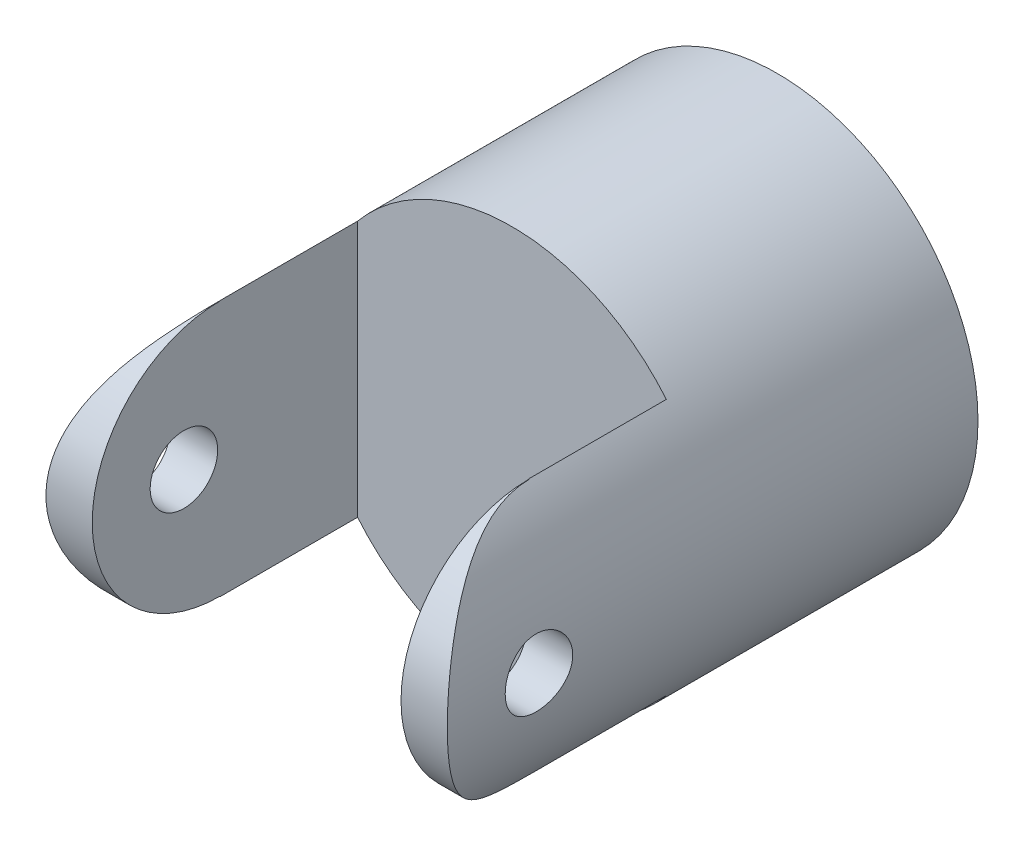
ISO-10303-21;
HEADER;
FILE_DESCRIPTION(('STEP AP214'),'2;1');
FILE_NAME('part.step','',(''),(''),'','','');
FILE_SCHEMA(('AUTOMOTIVE_DESIGN { 1 0 10303 214 1 1 1 1 }'));
ENDSEC;
DATA;
#1=APPLICATION_CONTEXT('core data for automotive mechanical design processes');
#2=APPLICATION_PROTOCOL_DEFINITION('international standard','automotive_design',2000,#1);
#3=PRODUCT_CONTEXT('',#1,'mechanical');
#4=PRODUCT('Part','Part','',(#3));
#5=PRODUCT_RELATED_PRODUCT_CATEGORY('part','',(#4));
#6=PRODUCT_DEFINITION_FORMATION('','',#4);
#7=PRODUCT_DEFINITION_CONTEXT('part definition',#1,'design');
#8=PRODUCT_DEFINITION('design','',#6,#7);
#9=PRODUCT_DEFINITION_SHAPE('','',#8);
#10=(LENGTH_UNIT() NAMED_UNIT(*) SI_UNIT(.MILLI.,.METRE.));
#11=(NAMED_UNIT(*) PLANE_ANGLE_UNIT() SI_UNIT($,.RADIAN.));
#12=(NAMED_UNIT(*) SI_UNIT($,.STERADIAN.) SOLID_ANGLE_UNIT());
#13=UNCERTAINTY_MEASURE_WITH_UNIT(LENGTH_MEASURE(1.E-05),#10,'distance_accuracy_value','');
#14=(GEOMETRIC_REPRESENTATION_CONTEXT(3) GLOBAL_UNCERTAINTY_ASSIGNED_CONTEXT((#13)) GLOBAL_UNIT_ASSIGNED_CONTEXT((#10,
#11,#12)) REPRESENTATION_CONTEXT('',''));
#15=CARTESIAN_POINT('',(0.,0.,0.));
#16=DIRECTION('',(0.,0.,1.));
#17=DIRECTION('',(1.,0.,0.));
#18=AXIS2_PLACEMENT_3D('',#15,#16,#17);
#19=CARTESIAN_POINT('',(0.,0.,11.));
#20=DIRECTION('',(0.,0.,-1.));
#21=DIRECTION('',(-1.,0.,0.));
#22=AXIS2_PLACEMENT_3D('',#19,#20,#21);
#23=CYLINDRICAL_SURFACE('',#22,4.16);
#24=CARTESIAN_POINT('',(-4.16,0.,8.4));
#25=CARTESIAN_POINT('',(-4.1599993277621,0.0390239125747628,8.40000155977883));
#26=CARTESIAN_POINT('',(-4.15944517372982,0.0780689849075887,8.4032743076211));
#27=CARTESIAN_POINT('',(-4.15728790947244,0.155063659220866,8.41627316724561));
#28=CARTESIAN_POINT('',(-4.1556838404645,0.193012226766777,8.42600517774355));
#29=CARTESIAN_POINT('',(-4.15160662871372,0.266688829253378,8.4516200868742));
#30=CARTESIAN_POINT('',(-4.1491342024726,0.302418666403529,8.46749791554888));
#31=CARTESIAN_POINT('',(-4.14359199062741,0.37070263465631,8.50494038987474));
#32=CARTESIAN_POINT('',(-4.14052227188301,0.403257120589323,8.52650439912268));
#33=CARTESIAN_POINT('',(-4.13409224580627,0.46458772784988,8.57493043107718));
#34=CARTESIAN_POINT('',(-4.13072963903228,0.493328446142046,8.6018369904627));
#35=CARTESIAN_POINT('',(-4.12411038432244,0.545909827859605,8.66008848698301));
#36=CARTESIAN_POINT('',(-4.12085374315079,0.569750178990013,8.69143370677385));
#37=CARTESIAN_POINT('',(-4.11479287163596,0.61199635700962,8.75791645283517));
#38=CARTESIAN_POINT('',(-4.11199161196014,0.630367102184491,8.79307656609853));
#39=CARTESIAN_POINT('',(-4.10719060804984,0.660928230525133,8.86603863677661));
#40=CARTESIAN_POINT('',(-4.10519080860076,0.673119039457476,8.90384041198986));
#41=CARTESIAN_POINT('',(-4.1022420557679,0.69086254711526,8.98063721227013));
#42=CARTESIAN_POINT('',(-4.10128342559077,0.696476412201096,9.01961772655558));
#43=CARTESIAN_POINT('',(-4.10049628461693,0.701096337075264,9.09797832626149));
#44=CARTESIAN_POINT('',(-4.10066769229779,0.700102873524991,9.13735838265381));
#45=CARTESIAN_POINT('',(-4.1021124270041,0.691586147504626,9.21496310071234));
#46=CARTESIAN_POINT('',(-4.10337414803079,0.68413165787628,9.25319555739738));
#47=CARTESIAN_POINT('',(-4.10683917312899,0.663012441156744,9.32785926339887));
#48=CARTESIAN_POINT('',(-4.10904251006289,0.649347497319705,9.3642904498015));
#49=CARTESIAN_POINT('',(-4.11415501382972,0.616125724703303,9.43452301139548));
#50=CARTESIAN_POINT('',(-4.11706758136741,0.596540395518846,9.46831064744649));
#51=CARTESIAN_POINT('',(-4.12326802042378,0.552054037069553,9.53214599064827));
#52=CARTESIAN_POINT('',(-4.12655592279497,0.527152570671694,9.56219338992663));
#53=CARTESIAN_POINT('',(-4.13318753266133,0.47236637629369,9.61809336013438));
#54=CARTESIAN_POINT('',(-4.13653142033276,0.442422655344115,9.64388812707109));
#55=CARTESIAN_POINT('',(-4.14285984072331,0.37860130707401,9.69009584686133));
#56=CARTESIAN_POINT('',(-4.14584437104319,0.344723653491564,9.71050876378405));
#57=CARTESIAN_POINT('',(-4.1511221620187,0.273941318469586,9.74537883203141));
#58=CARTESIAN_POINT('',(-4.15341482187015,0.237034041344438,9.75983081098754));
#59=CARTESIAN_POINT('',(-4.1570457409022,0.161268902511086,9.78231477164084));
#60=CARTESIAN_POINT('',(-4.15838408148438,0.122411207472467,9.7903473009117));
#61=CARTESIAN_POINT('',(-4.15994460407459,0.0443464102274835,9.79968583493131));
#62=CARTESIAN_POINT('',(-4.16017995079601,0.00514905333311402,9.80107118148655));
#63=CARTESIAN_POINT('',(-4.1595440480163,-0.0729176566416257,9.79728764814687));
#64=CARTESIAN_POINT('',(-4.15867284194514,-0.111787022534712,9.79211902548208));
#65=CARTESIAN_POINT('',(-4.15592987811917,-0.187848839546986,9.77544026231971));
#66=CARTESIAN_POINT('',(-4.15406433008375,-0.225050161244746,9.76396946569981));
#67=CARTESIAN_POINT('',(-4.14954102253772,-0.297001702403252,9.73505395660164));
#68=CARTESIAN_POINT('',(-4.14688321783,-0.331751781884226,9.71760890329211));
#69=CARTESIAN_POINT('',(-4.14103756729968,-0.398158605742829,9.67705881107004));
#70=CARTESIAN_POINT('',(-4.13784517038284,-0.429784726143966,9.6539042896113));
#71=CARTESIAN_POINT('',(-4.13129802571993,-0.488730817092044,9.60266051997944));
#72=CARTESIAN_POINT('',(-4.12794326595238,-0.516050468145263,9.57457090600211));
#73=CARTESIAN_POINT('',(-4.12140684889181,-0.565902760035183,9.51389821469653));
#74=CARTESIAN_POINT('',(-4.11822739594523,-0.588381753338073,9.4812707822775));
#75=CARTESIAN_POINT('',(-4.11244297967972,-0.62753977754453,9.41265632538366));
#76=CARTESIAN_POINT('',(-4.10983799789771,-0.6442189948586,9.37666940893314));
#77=CARTESIAN_POINT('',(-4.1055140656407,-0.671224072877987,9.30250651334735));
#78=CARTESIAN_POINT('',(-4.10379141775969,-0.681576481831249,9.26434042661519));
#79=CARTESIAN_POINT('',(-4.10141798088834,-0.695717505748562,9.18677960808961));
#80=CARTESIAN_POINT('',(-4.10076709673286,-0.699506703481541,9.14738498569812));
#81=CARTESIAN_POINT('',(-4.10061503803945,-0.70039725202405,9.06902118945909));
#82=CARTESIAN_POINT('',(-4.10109934457034,-0.697583058792982,9.0300529778608));
#83=CARTESIAN_POINT('',(-4.10313125058084,-0.685529497995793,8.9531529833514));
#84=CARTESIAN_POINT('',(-4.10467884642083,-0.676290152422942,8.91522119689308));
#85=CARTESIAN_POINT('',(-4.10865739445353,-0.651681156604191,8.84150439132123));
#86=CARTESIAN_POINT('',(-4.11108727872626,-0.636318915311279,8.80571683758478));
#87=CARTESIAN_POINT('',(-4.11655762981038,-0.599908920025351,8.73721334940979));
#88=CARTESIAN_POINT('',(-4.1195981278615,-0.578860875120836,8.70449757225273));
#89=CARTESIAN_POINT('',(-4.12599307843607,-0.531375902753995,8.64263988511162));
#90=CARTESIAN_POINT('',(-4.12935088277078,-0.504876889588195,8.61354597472536));
#91=CARTESIAN_POINT('',(-4.13597549546759,-0.447373004296234,8.56018888428044));
#92=CARTESIAN_POINT('',(-4.13924228266241,-0.416367094283321,8.53592681999919));
#93=CARTESIAN_POINT('',(-4.14534350893309,-0.350469460605587,8.49276545794503));
#94=CARTESIAN_POINT('',(-4.14817473607019,-0.315551872090762,8.47390519165113));
#95=CARTESIAN_POINT('',(-4.15305458015047,-0.243010434628081,8.44234710952398));
#96=CARTESIAN_POINT('',(-4.15510397288708,-0.205389312618788,8.42964318151871));
#97=CARTESIAN_POINT('',(-4.15774414448338,-0.139687071677165,8.41350289017298));
#98=CARTESIAN_POINT('',(-4.15858555014462,-0.112002502096261,8.40844745508329));
#99=CARTESIAN_POINT('',(-4.15971371512396,-0.0562156106525505,8.40169547796901));
#100=CARTESIAN_POINT('',(-4.16000048428827,-0.028113296214703,8.39999887631656));
#101=CARTESIAN_POINT('',(-4.16,0.,8.4));
#102=B_SPLINE_CURVE_WITH_KNOTS('',3,(#24,#25,#26,#27,#28,#29,#30,#31,#32,#33,#34,#35,#36,#37,
#38,#39,#40,#41,#42,#43,#44,#45,#46,#47,#48,#49,#50,#51,#52,#53,#54,#55,#56,#57,#58,#59,#60,#61,
#62,#63,#64,#65,#66,#67,#68,#69,#70,#71,#72,#73,#74,#75,#76,#77,#78,#79,#80,#81,#82,#83,#84,#85,
#86,#87,#88,#89,#90,#91,#92,#93,#94,#95,#96,#97,#98,#99,#100,#101),.UNSPECIFIED.,.T.,.F.,(4,2,2,
2,2,2,2,2,2,2,2,2,2,2,2,2,2,2,2,2,2,2,2,2,2,2,2,2,2,2,2,2,2,2,2,2,2,2,4),(0.,0.116968971867076,
0.234044909163309,0.351024470460435,0.467990944836635,0.585976836802057,0.703970245548359,
0.82270491376216,0.941431400641504,1.05904472417866,1.1766495630277,1.29301774815333,
1.40938999485922,1.52633162208068,1.6432828688337,1.76171192378295,1.88014176937935,
1.99867416270379,2.11719644423498,2.23430044546542,2.35139985074145,2.46777638798962,
2.58415956562407,2.70158922800758,2.81902759831333,2.93770721667888,3.05638302021214,
3.17455736019733,3.29272120655945,3.409382015381,3.52604242487508,3.64256209702446,
3.75908773197823,3.87702241655098,3.99498430328666,4.11377819537088,4.23245390293315,
4.31672125379096,4.4009871086749),.UNSPECIFIED.);
#103=CARTESIAN_POINT('',(-4.16,0.,8.4));
#104=VERTEX_POINT('',#103);
#105=EDGE_CURVE('E145',#104,#104,#102,.T.);
#106=ORIENTED_EDGE('',*,*,#105,.T.);
#107=EDGE_LOOP('',(#106));
#108=FACE_BOUND('',#107,.T.);
#109=CARTESIAN_POINT('',(4.16,0.,8.4));
#110=CARTESIAN_POINT('',(4.1599993277621,-0.0390239125747628,8.40000155977883));
#111=CARTESIAN_POINT('',(4.15944517372982,-0.0780689849075887,8.4032743076211));
#112=CARTESIAN_POINT('',(4.15728790947244,-0.155063659220866,8.41627316724561));
#113=CARTESIAN_POINT('',(4.1556838404645,-0.193012226766777,8.42600517774355));
#114=CARTESIAN_POINT('',(4.15160662871372,-0.266688829253378,8.4516200868742));
#115=CARTESIAN_POINT('',(4.1491342024726,-0.302418666403529,8.46749791554888));
#116=CARTESIAN_POINT('',(4.14359199062741,-0.37070263465631,8.50494038987474));
#117=CARTESIAN_POINT('',(4.14052227188301,-0.403257120589323,8.52650439912268));
#118=CARTESIAN_POINT('',(4.13409224580627,-0.46458772784988,8.57493043107718));
#119=CARTESIAN_POINT('',(4.13072963903228,-0.493328446142046,8.6018369904627));
#120=CARTESIAN_POINT('',(4.12411038432244,-0.545909827859605,8.66008848698301));
#121=CARTESIAN_POINT('',(4.12085374315079,-0.569750178990013,8.69143370677385));
#122=CARTESIAN_POINT('',(4.11479287163596,-0.61199635700962,8.75791645283517));
#123=CARTESIAN_POINT('',(4.11199161196014,-0.630367102184491,8.79307656609853));
#124=CARTESIAN_POINT('',(4.10719060804984,-0.660928230525133,8.86603863677661));
#125=CARTESIAN_POINT('',(4.10519080860076,-0.673119039457476,8.90384041198986));
#126=CARTESIAN_POINT('',(4.1022420557679,-0.69086254711526,8.98063721227013));
#127=CARTESIAN_POINT('',(4.10128342559077,-0.696476412201096,9.01961772655558));
#128=CARTESIAN_POINT('',(4.10049628461693,-0.701096337075264,9.09797832626149));
#129=CARTESIAN_POINT('',(4.10066769229779,-0.700102873524991,9.13735838265381));
#130=CARTESIAN_POINT('',(4.1021124270041,-0.691586147504626,9.21496310071234));
#131=CARTESIAN_POINT('',(4.10337414803079,-0.68413165787628,9.25319555739738));
#132=CARTESIAN_POINT('',(4.10683917312899,-0.663012441156744,9.32785926339887));
#133=CARTESIAN_POINT('',(4.10904251006289,-0.649347497319705,9.3642904498015));
#134=CARTESIAN_POINT('',(4.11415501382972,-0.616125724703303,9.43452301139548));
#135=CARTESIAN_POINT('',(4.11706758136741,-0.596540395518846,9.46831064744649));
#136=CARTESIAN_POINT('',(4.12326802042378,-0.552054037069553,9.53214599064827));
#137=CARTESIAN_POINT('',(4.12655592279497,-0.527152570671694,9.56219338992663));
#138=CARTESIAN_POINT('',(4.13318753266133,-0.47236637629369,9.61809336013438));
#139=CARTESIAN_POINT('',(4.13653142033276,-0.442422655344115,9.64388812707109));
#140=CARTESIAN_POINT('',(4.14285984072331,-0.37860130707401,9.69009584686133));
#141=CARTESIAN_POINT('',(4.14584437104319,-0.344723653491564,9.71050876378405));
#142=CARTESIAN_POINT('',(4.1511221620187,-0.273941318469586,9.74537883203141));
#143=CARTESIAN_POINT('',(4.15341482187015,-0.237034041344438,9.75983081098754));
#144=CARTESIAN_POINT('',(4.1570457409022,-0.161268902511086,9.78231477164084));
#145=CARTESIAN_POINT('',(4.15838408148438,-0.122411207472467,9.7903473009117));
#146=CARTESIAN_POINT('',(4.15994460407459,-0.0443464102274835,9.79968583493131));
#147=CARTESIAN_POINT('',(4.16017995079601,-0.00514905333311402,9.80107118148655));
#148=CARTESIAN_POINT('',(4.1595440480163,0.0729176566416257,9.79728764814687));
#149=CARTESIAN_POINT('',(4.15867284194514,0.111787022534712,9.79211902548208));
#150=CARTESIAN_POINT('',(4.15592987811917,0.187848839546986,9.77544026231971));
#151=CARTESIAN_POINT('',(4.15406433008375,0.225050161244746,9.76396946569981));
#152=CARTESIAN_POINT('',(4.14954102253772,0.297001702403252,9.73505395660164));
#153=CARTESIAN_POINT('',(4.14688321783,0.331751781884226,9.71760890329211));
#154=CARTESIAN_POINT('',(4.14103756729968,0.398158605742829,9.67705881107004));
#155=CARTESIAN_POINT('',(4.13784517038284,0.429784726143966,9.6539042896113));
#156=CARTESIAN_POINT('',(4.13129802571993,0.488730817092044,9.60266051997944));
#157=CARTESIAN_POINT('',(4.12794326595238,0.516050468145263,9.57457090600211));
#158=CARTESIAN_POINT('',(4.12140684889181,0.565902760035183,9.51389821469653));
#159=CARTESIAN_POINT('',(4.11822739594523,0.588381753338073,9.4812707822775));
#160=CARTESIAN_POINT('',(4.11244297967972,0.62753977754453,9.41265632538366));
#161=CARTESIAN_POINT('',(4.10983799789771,0.6442189948586,9.37666940893314));
#162=CARTESIAN_POINT('',(4.1055140656407,0.671224072877987,9.30250651334735));
#163=CARTESIAN_POINT('',(4.10379141775969,0.681576481831249,9.26434042661519));
#164=CARTESIAN_POINT('',(4.10141798088834,0.695717505748562,9.18677960808961));
#165=CARTESIAN_POINT('',(4.10076709673286,0.699506703481541,9.14738498569812));
#166=CARTESIAN_POINT('',(4.10061503803945,0.70039725202405,9.06902118945909));
#167=CARTESIAN_POINT('',(4.10109934457034,0.697583058792982,9.0300529778608));
#168=CARTESIAN_POINT('',(4.10313125058084,0.685529497995793,8.9531529833514));
#169=CARTESIAN_POINT('',(4.10467884642083,0.676290152422942,8.91522119689308));
#170=CARTESIAN_POINT('',(4.10865739445353,0.651681156604191,8.84150439132123));
#171=CARTESIAN_POINT('',(4.11108727872626,0.636318915311279,8.80571683758478));
#172=CARTESIAN_POINT('',(4.11655762981038,0.599908920025351,8.73721334940979));
#173=CARTESIAN_POINT('',(4.1195981278615,0.578860875120836,8.70449757225273));
#174=CARTESIAN_POINT('',(4.12599307843607,0.531375902753995,8.64263988511162));
#175=CARTESIAN_POINT('',(4.12935088277078,0.504876889588195,8.61354597472536));
#176=CARTESIAN_POINT('',(4.13597549546759,0.447373004296234,8.56018888428044));
#177=CARTESIAN_POINT('',(4.13924228266241,0.416367094283321,8.53592681999919));
#178=CARTESIAN_POINT('',(4.14534350893309,0.350469460605587,8.49276545794503));
#179=CARTESIAN_POINT('',(4.14817473607019,0.315551872090762,8.47390519165113));
#180=CARTESIAN_POINT('',(4.15305458015047,0.243010434628081,8.44234710952398));
#181=CARTESIAN_POINT('',(4.15510397288708,0.205389312618788,8.42964318151871));
#182=CARTESIAN_POINT('',(4.15774414448338,0.139687071677165,8.41350289017298));
#183=CARTESIAN_POINT('',(4.15858555014462,0.112002502096261,8.40844745508329));
#184=CARTESIAN_POINT('',(4.15971371512396,0.0562156106525505,8.40169547796901));
#185=CARTESIAN_POINT('',(4.16000048428827,0.028113296214703,8.39999887631656));
#186=CARTESIAN_POINT('',(4.16,0.,8.4));
#187=B_SPLINE_CURVE_WITH_KNOTS('',3,(#109,#110,#111,#112,#113,#114,#115,#116,#117,#118,#119,
#120,#121,#122,#123,#124,#125,#126,#127,#128,#129,#130,#131,#132,#133,#134,#135,#136,#137,#138,
#139,#140,#141,#142,#143,#144,#145,#146,#147,#148,#149,#150,#151,#152,#153,#154,#155,#156,#157,
#158,#159,#160,#161,#162,#163,#164,#165,#166,#167,#168,#169,#170,#171,#172,#173,#174,#175,#176,
#177,#178,#179,#180,#181,#182,#183,#184,#185,#186),.UNSPECIFIED.,.T.,.F.,(4,2,2,2,2,2,2,2,2,2,2,
2,2,2,2,2,2,2,2,2,2,2,2,2,2,2,2,2,2,2,2,2,2,2,2,2,2,2,4),(0.,0.116968971867076,
0.234044909163309,0.351024470460435,0.467990944836635,0.585976836802057,0.703970245548359,
0.82270491376216,0.941431400641504,1.05904472417866,1.1766495630277,1.29301774815333,
1.40938999485922,1.52633162208068,1.6432828688337,1.76171192378295,1.88014176937935,
1.99867416270379,2.11719644423498,2.23430044546542,2.35139985074145,2.46777638798962,
2.58415956562407,2.70158922800758,2.81902759831333,2.93770721667888,3.05638302021214,
3.17455736019733,3.29272120655945,3.409382015381,3.52604242487508,3.64256209702446,
3.75908773197823,3.87702241655098,3.99498430328666,4.11377819537088,4.23245390293315,
4.31672125379096,4.4009871086749),.UNSPECIFIED.);
#188=CARTESIAN_POINT('',(4.16,0.,8.4));
#189=VERTEX_POINT('',#188);
#190=EDGE_CURVE('E152',#189,#189,#187,.T.);
#191=ORIENTED_EDGE('',*,*,#190,.T.);
#192=EDGE_LOOP('',(#191));
#193=FACE_BOUND('',#192,.T.);
#194=DIRECTION('',(0.,0.,-1.));
#195=VECTOR('',#194,1.);
#196=CARTESIAN_POINT('',(3.2,2.65811963613378,11.));
#197=LINE('',#196,#195);
#198=CARTESIAN_POINT('',(3.2,2.65811963613378,5.5));
#199=VERTEX_POINT('',#198);
#200=CARTESIAN_POINT('',(3.2,2.65811963613378,8.35));
#201=VERTEX_POINT('',#200);
#202=EDGE_CURVE('E196',#199,#201,#197,.F.);
#203=ORIENTED_EDGE('',*,*,#202,.T.);
#204=CARTESIAN_POINT('',(0.,0.,8.35));
#205=DIRECTION('',(0.,0.,-1.));
#206=DIRECTION('',(-1.,0.,0.));
#207=AXIS2_PLACEMENT_3D('',#204,#205,#206);
#208=CIRCLE('',#207,4.16);
#209=CARTESIAN_POINT('',(3.20672730365399,2.65,8.35));
#210=VERTEX_POINT('',#209);
#211=EDGE_CURVE('E121',#201,#210,#208,.T.);
#212=ORIENTED_EDGE('',*,*,#211,.T.);
#213=CARTESIAN_POINT('',(3.20672730365399,2.65,8.35));
#214=CARTESIAN_POINT('',(3.20669505811809,2.6500160283953,8.41600762728984));
#215=CARTESIAN_POINT('',(3.20876451539116,2.64753446292586,8.48199574117056));
#216=CARTESIAN_POINT('',(3.21686000468512,2.63770436351235,8.6132897334531));
#217=CARTESIAN_POINT('',(3.22288144484862,2.63036147790947,8.67859631438047));
#218=CARTESIAN_POINT('',(3.23856426362669,2.61102379201802,8.8074575561479));
#219=CARTESIAN_POINT('',(3.24819241085993,2.59907143356764,8.87102269200466));
#220=CARTESIAN_POINT('',(3.27067722024509,2.57071954376607,8.99656510040091));
#221=CARTESIAN_POINT('',(3.28353467768257,2.55431891685561,9.05854197764881));
#222=CARTESIAN_POINT('',(3.32611454748676,2.49894471907308,9.24098633080575));
#223=CARTESIAN_POINT('',(3.35993644993818,2.45369268273078,9.35865168939531));
#224=CARTESIAN_POINT('',(3.43457647325418,2.34807721097754,9.58478456622257));
#225=CARTESIAN_POINT('',(3.47541252786229,2.28767485244232,9.69322741462268));
#226=CARTESIAN_POINT('',(3.56626107151885,2.14373021273325,9.91416620206438));
#227=CARTESIAN_POINT('',(3.61676021769055,2.05813888489881,10.0251318104465));
#228=CARTESIAN_POINT('',(3.71728722279422,1.87049295958019,10.2323745995469));
#229=CARTESIAN_POINT('',(3.76731489010916,1.76843195013416,10.3286460310212));
#230=CARTESIAN_POINT('',(3.86884717703238,1.5348454058189,10.5160688473868));
#231=CARTESIAN_POINT('',(3.91972805251957,1.40122264248246,10.6050055882579));
#232=CARTESIAN_POINT('',(3.98736678964662,1.18831579844764,10.7200076573631));
#233=CARTESIAN_POINT('',(4.00847126438806,1.11524286278054,10.7552827883369));
#234=CARTESIAN_POINT('',(4.04716932801902,0.965395181767101,10.8192372236001));
#235=CARTESIAN_POINT('',(4.06476539462032,0.888623096755101,10.8479211849109));
#236=CARTESIAN_POINT('',(4.09424894951388,0.740165723076318,10.8956013634813));
#237=CARTESIAN_POINT('',(4.10654021793189,0.66878394332158,10.9152955999517));
#238=CARTESIAN_POINT('',(4.1274934437329,0.524149274703781,10.9487057885936));
#239=CARTESIAN_POINT('',(4.13615753349387,0.450897512134977,10.9624252534582));
#240=CARTESIAN_POINT('',(4.14959852568186,0.303189053306739,10.9836545651541));
#241=CARTESIAN_POINT('',(4.1543779963417,0.228733186382834,10.9911685146823));
#242=CARTESIAN_POINT('',(4.1599167354821,0.0793302960709673,10.9998707866687));
#243=CARTESIAN_POINT('',(4.16067649481135,0.00438333376997673,11.0010598814578));
#244=CARTESIAN_POINT('',(4.15721299561737,-0.199206688897612,10.9956282507606));
#245=CARTESIAN_POINT('',(4.14901150521583,-0.327688754379458,10.9827733557036));
#246=CARTESIAN_POINT('',(4.12131045618796,-0.580151905277748,10.9388954717403));
#247=CARTESIAN_POINT('',(4.10180999423465,-0.704132629980009,10.9078710302181));
#248=CARTESIAN_POINT('',(4.05316605362649,-0.944735368137761,10.8291156027387));
#249=CARTESIAN_POINT('',(4.02401422814085,-1.06135090761252,10.7813701538064));
#250=CARTESIAN_POINT('',(3.95829117182254,-1.28496546345559,10.6709765815365));
#251=CARTESIAN_POINT('',(3.92171885331419,-1.3919630667314,10.6083262732527));
#252=CARTESIAN_POINT('',(3.83867583176293,-1.60784718202649,10.4610422617027));
#253=CARTESIAN_POINT('',(3.79153825590707,-1.7152617391232,10.3746305218407));
#254=CARTESIAN_POINT('',(3.69466426676838,-1.9150511808397,10.186823635248));
#255=CARTESIAN_POINT('',(3.64492307670927,-2.00739704388281,10.0854002765597));
#256=CARTESIAN_POINT('',(3.54020951927387,-2.18741463652778,9.85403254771881));
#257=CARTESIAN_POINT('',(3.48546866291426,-2.27266094269475,9.72208345679977));
#258=CARTESIAN_POINT('',(3.38529956286428,-2.41934756100157,9.44267970306101));
#259=CARTESIAN_POINT('',(3.33983524936024,-2.48088093909605,9.29528860523034));
#260=CARTESIAN_POINT('',(3.28801692378069,-2.54855896361415,9.0791554870462));
#261=CARTESIAN_POINT('',(3.2744440105472,-2.56592756537774,9.0155136448719));
#262=CARTESIAN_POINT('',(3.25068197969008,-2.5959646101103,8.88651346554289));
#263=CARTESIAN_POINT('',(3.24049146008133,-2.60863500071993,8.82115585171927));
#264=CARTESIAN_POINT('',(3.22387519894656,-2.62914734735592,8.68855789981288));
#265=CARTESIAN_POINT('',(3.21748644109494,-2.63694190737749,8.6213055264091));
#266=CARTESIAN_POINT('',(3.20889148108242,-2.64738082111482,8.48604368824188));
#267=CARTESIAN_POINT('',(3.20669125515124,-2.65001781612364,8.41803328076841));
#268=CARTESIAN_POINT('',(3.20672730365399,-2.65,8.35));
#269=B_SPLINE_CURVE_WITH_KNOTS('',3,(#213,#214,#215,#216,#217,#218,#219,#220,#221,#222,#223,
#224,#225,#226,#227,#228,#229,#230,#231,#232,#233,#234,#235,#236,#237,#238,#239,#240,#241,#242,
#243,#244,#245,#246,#247,#248,#249,#250,#251,#252,#253,#254,#255,#256,#257,#258,#259,#260,#261,
#262,#263,#264,#265,#266,#267,#268),.UNSPECIFIED.,.F.,.F.,(4,2,2,2,2,2,2,2,2,2,2,2,2,2,2,2,2,2,
2,2,2,2,2,2,2,2,2,4),(0.,0.197912306414299,0.395595062230328,0.591499506597758,
0.787452243942295,1.17728912478481,1.56813799322805,2.01329217126134,2.45862007630531,
2.96067962611412,3.21186909182646,3.46288052896882,3.68773681749321,3.91246072924424,
4.1370359484587,4.36158374406302,4.74768030588197,5.13380773949987,5.5202699855289,
5.90678891911809,6.34218253133714,6.77840503827903,7.27514024766802,7.7699055719821,
7.97174320317075,8.17349706889667,8.37718281200512,8.58115895832141),.UNSPECIFIED.);
#270=CARTESIAN_POINT('',(3.20672730365399,-2.65,8.35));
#271=VERTEX_POINT('',#270);
#272=EDGE_CURVE('E122',#210,#271,#269,.T.);
#273=ORIENTED_EDGE('',*,*,#272,.T.);
#274=CARTESIAN_POINT('',(0.,0.,8.35));
#275=DIRECTION('',(0.,0.,-1.));
#276=DIRECTION('',(-1.,0.,0.));
#277=AXIS2_PLACEMENT_3D('',#274,#275,#276);
#278=CIRCLE('',#277,4.16);
#279=CARTESIAN_POINT('',(3.2,-2.65811963613378,8.35));
#280=VERTEX_POINT('',#279);
#281=EDGE_CURVE('E135',#271,#280,#278,.T.);
#282=ORIENTED_EDGE('',*,*,#281,.T.);
#283=DIRECTION('',(0.,0.,-1.));
#284=VECTOR('',#283,1.);
#285=CARTESIAN_POINT('',(3.2,-2.65811963613378,11.));
#286=LINE('',#285,#284);
#287=CARTESIAN_POINT('',(3.2,-2.65811963613378,5.5));
#288=VERTEX_POINT('',#287);
#289=EDGE_CURVE('E201',#280,#288,#286,.T.);
#290=ORIENTED_EDGE('',*,*,#289,.T.);
#291=CARTESIAN_POINT('',(0.,0.,5.5));
#292=DIRECTION('',(0.,0.,-1.));
#293=DIRECTION('',(-1.,0.,0.));
#294=AXIS2_PLACEMENT_3D('',#291,#292,#293);
#295=CIRCLE('',#294,4.16);
#296=CARTESIAN_POINT('',(-3.2,-2.65811963613378,5.5));
#297=VERTEX_POINT('',#296);
#298=EDGE_CURVE('E212',#288,#297,#295,.T.);
#299=ORIENTED_EDGE('',*,*,#298,.T.);
#300=DIRECTION('',(0.,0.,-1.));
#301=VECTOR('',#300,1.);
#302=CARTESIAN_POINT('',(-3.2,-2.65811963613378,11.));
#303=LINE('',#302,#301);
#304=CARTESIAN_POINT('',(-3.2,-2.65811963613378,8.35));
#305=VERTEX_POINT('',#304);
#306=EDGE_CURVE('E132',#297,#305,#303,.F.);
#307=ORIENTED_EDGE('',*,*,#306,.T.);
#308=CARTESIAN_POINT('',(-3.20672730365399,-2.65,8.35));
#309=VERTEX_POINT('',#308);
#310=EDGE_CURVE('E60',#305,#309,#278,.T.);
#311=ORIENTED_EDGE('',*,*,#310,.T.);
#312=CARTESIAN_POINT('',(-3.20672730365399,-2.65,8.35));
#313=CARTESIAN_POINT('',(-3.2066950569446,-2.65001603233073,8.41600786618289));
#314=CARTESIAN_POINT('',(-3.20876452986633,-2.6475344468261,8.48199622095595));
#315=CARTESIAN_POINT('',(-3.21686007840042,-2.63770427239442,8.61329068726936));
#316=CARTESIAN_POINT('',(-3.22288156206535,-2.63036133191998,8.67859750135164));
#317=CARTESIAN_POINT('',(-3.23856443279243,-2.61102358495306,8.80745872341925));
#318=CARTESIAN_POINT('',(-3.24819256173721,-2.59907125438728,8.87102361493784));
#319=CARTESIAN_POINT('',(-3.27067731712963,-2.5707194105278,8.99656556076683));
#320=CARTESIAN_POINT('',(-3.2835347388135,-2.55431880173449,9.0585422198147));
#321=CARTESIAN_POINT('',(-3.32611457476561,-2.49894475446523,9.24098648701093));
#322=CARTESIAN_POINT('',(-3.35993646170183,-2.45369304916129,9.35865186754687));
#323=CARTESIAN_POINT('',(-3.43457669832319,-2.34807650845614,9.58478510498086));
#324=CARTESIAN_POINT('',(-3.47541296077156,-2.28767279258207,9.69322832394361));
#325=CARTESIAN_POINT('',(-3.56625955812675,-2.14373417542528,9.91416268500063));
#326=CARTESIAN_POINT('',(-3.61675627016061,-2.0581516201372,10.0251233979166));
#327=CARTESIAN_POINT('',(-3.71728660122356,-1.87048875196189,10.2323735925183));
#328=CARTESIAN_POINT('',(-3.76732000894074,-1.76840126866439,10.3286566621578));
#329=CARTESIAN_POINT('',(-3.8688492910669,-1.53486185874963,10.5160714169269));
#330=CARTESIAN_POINT('',(-3.91971761678179,-1.40132533167105,10.6049793697717));
#331=CARTESIAN_POINT('',(-4.00989192119378,-1.1173435286487,10.7583142524245));
#332=CARTESIAN_POINT('',(-4.04921277108696,-0.966920348216277,10.8227727005503));
#333=CARTESIAN_POINT('',(-4.10598842074772,-0.681066195574498,10.9145838034583));
#334=CARTESIAN_POINT('',(-4.1260630588641,-0.547606621993921,10.9464514106566));
#335=CARTESIAN_POINT('',(-4.15306256562993,-0.276091731297322,10.9891499003433));
#336=CARTESIAN_POINT('',(-4.15999800756453,-0.138040200507549,10.9999976979112));
#337=CARTESIAN_POINT('',(-4.16000193935794,0.134362875325561,11.0000022407623));
#338=CARTESIAN_POINT('',(-4.15343491637915,0.268715015994844,10.9897291270513));
#339=CARTESIAN_POINT('',(-4.12783259780039,0.533163012478475,10.9492585268422));
#340=CARTESIAN_POINT('',(-4.10879262488342,0.66325725237042,10.9190535659328));
#341=CARTESIAN_POINT('',(-4.06013823412719,0.915023056300292,10.8404949745796));
#342=CARTESIAN_POINT('',(-4.0305701571117,1.0367287848497,10.7922208310381));
#343=CARTESIAN_POINT('',(-3.96329579799949,1.26989365901362,10.6795181501988));
#344=CARTESIAN_POINT('',(-3.92558868360515,1.38135175504229,10.6150879606754));
#345=CARTESIAN_POINT('',(-3.8415043235843,1.60105499277028,10.4661628419323));
#346=CARTESIAN_POINT('',(-3.79467192621944,1.70830638298094,10.3804643891463));
#347=CARTESIAN_POINT('',(-3.6983459740994,1.90791855907305,10.1941862081327));
#348=CARTESIAN_POINT('',(-3.64884786884299,2.0002527322788,10.0935804846254));
#349=CARTESIAN_POINT('',(-3.54431232561143,2.18077977305783,9.8636200954213));
#350=CARTESIAN_POINT('',(-3.48949306427323,2.26649898089916,9.7322116169376));
#351=CARTESIAN_POINT('',(-3.38894825584364,2.41425361264903,9.453860852767));
#352=CARTESIAN_POINT('',(-3.34318836242538,2.4763793417481,9.30698060265994));
#353=CARTESIAN_POINT('',(-3.29052405428252,2.54532856298086,9.09044275214302));
#354=CARTESIAN_POINT('',(-3.27655217465774,2.56323955814269,9.02589410258745));
#355=CARTESIAN_POINT('',(-3.25207648674413,2.59422181579563,8.89500400208282));
#356=CARTESIAN_POINT('',(-3.2415712138379,2.60729512246083,8.82866332110424));
#357=CARTESIAN_POINT('',(-3.22443216118824,2.62846658002187,8.69401504794051));
#358=CARTESIAN_POINT('',(-3.21783735754271,2.63651468478133,8.62569454704852));
#359=CARTESIAN_POINT('',(-3.2089625245374,2.64729484638864,8.48825826349253));
#360=CARTESIAN_POINT('',(-3.20668894286933,2.65001895948402,8.41914144698602));
#361=CARTESIAN_POINT('',(-3.20672730365399,2.65,8.35));
#362=B_SPLINE_CURVE_WITH_KNOTS('',3,(#312,#313,#314,#315,#316,#317,#318,#319,#320,#321,#322,
#323,#324,#325,#326,#327,#328,#329,#330,#331,#332,#333,#334,#335,#336,#337,#338,#339,#340,#341,
#342,#343,#344,#345,#346,#347,#348,#349,#350,#351,#352,#353,#354,#355,#356,#357,#358,#359,#360,
#361),.UNSPECIFIED.,.F.,.F.,(4,2,2,2,2,2,2,2,2,2,2,2,2,2,2,2,2,2,2,2,2,2,2,2,4),(0.,
0.19791302635126,0.395596498391126,0.591500226042087,0.787452243756272,1.17728974135386,
1.56813799281474,2.01328207878496,2.45862007564806,2.96076458630949,3.46225955502895,
3.87614858071767,4.28970440272061,4.69224329463494,5.09493322384377,5.49587213783643,
5.89685207126567,6.33035331513185,6.76461959349507,7.26089080684145,7.75524290024823,
7.96030445067044,8.16527925274726,8.37226414197891,8.5795576314723),.UNSPECIFIED.);
#363=CARTESIAN_POINT('',(-3.20672730365399,2.65,8.35));
#364=VERTEX_POINT('',#363);
#365=EDGE_CURVE('E114',#309,#364,#362,.T.);
#366=ORIENTED_EDGE('',*,*,#365,.T.);
#367=CARTESIAN_POINT('',(-3.2,2.65811963613378,8.35));
#368=VERTEX_POINT('',#367);
#369=EDGE_CURVE('E191',#364,#368,#208,.T.);
#370=ORIENTED_EDGE('',*,*,#369,.T.);
#371=DIRECTION('',(0.,0.,-1.));
#372=VECTOR('',#371,1.);
#373=CARTESIAN_POINT('',(-3.2,2.65811963613378,11.));
#374=LINE('',#373,#372);
#375=CARTESIAN_POINT('',(-3.2,2.65811963613378,5.5));
#376=VERTEX_POINT('',#375);
#377=EDGE_CURVE('E204',#368,#376,#374,.T.);
#378=ORIENTED_EDGE('',*,*,#377,.T.);
#379=EDGE_CURVE('E209',#376,#199,#295,.T.);
#380=ORIENTED_EDGE('',*,*,#379,.T.);
#381=EDGE_LOOP('',(#203,#212,#273,#282,#290,#299,#307,#311,#366,#370,#378,#380));
#382=FACE_BOUND('',#381,.T.);
#383=CARTESIAN_POINT('',(0.,0.,0.));
#384=DIRECTION('',(0.,0.,1.));
#385=DIRECTION('',(1.,0.,0.));
#386=AXIS2_PLACEMENT_3D('',#383,#384,#385);
#387=CIRCLE('',#386,4.16);
#388=CARTESIAN_POINT('',(4.16,0.,0.));
#389=VERTEX_POINT('',#388);
#390=EDGE_CURVE('E206',#389,#389,#387,.T.);
#391=ORIENTED_EDGE('',*,*,#390,.T.);
#392=EDGE_LOOP('',(#391));
#393=FACE_BOUND('',#392,.T.);
#394=ADVANCED_FACE('F44',(#108,#193,#382,#393),#23,.T.);
#395=CARTESIAN_POINT('',(0.,0.,0.));
#396=DIRECTION('',(0.,0.,1.));
#397=DIRECTION('',(1.,0.,0.));
#398=AXIS2_PLACEMENT_3D('',#395,#396,#397);
#399=PLANE('',#398);
#400=ORIENTED_EDGE('',*,*,#390,.F.);
#401=EDGE_LOOP('',(#400));
#402=FACE_BOUND('',#401,.T.);
#403=ADVANCED_FACE('F232',(#402),#399,.F.);
#404=CARTESIAN_POINT('',(-3.2,-4.16,5.5));
#405=DIRECTION('',(0.,0.,-1.));
#406=DIRECTION('',(-1.,0.,0.));
#407=AXIS2_PLACEMENT_3D('',#404,#405,#406);
#408=PLANE('',#407);
#409=DIRECTION('',(0.,1.,0.));
#410=VECTOR('',#409,1.);
#411=CARTESIAN_POINT('',(-3.2,-4.16,5.5));
#412=LINE('',#411,#410);
#413=EDGE_CURVE('E193',#297,#376,#412,.T.);
#414=ORIENTED_EDGE('',*,*,#413,.F.);
#415=ORIENTED_EDGE('',*,*,#298,.F.);
#416=DIRECTION('',(0.,1.,0.));
#417=VECTOR('',#416,1.);
#418=CARTESIAN_POINT('',(3.2,-4.16,5.5));
#419=LINE('',#418,#417);
#420=EDGE_CURVE('E197',#288,#199,#419,.T.);
#421=ORIENTED_EDGE('',*,*,#420,.T.);
#422=ORIENTED_EDGE('',*,*,#379,.F.);
#423=EDGE_LOOP('',(#414,#415,#421,#422));
#424=FACE_BOUND('',#423,.T.);
#425=ADVANCED_FACE('F236',(#424),#408,.F.);
#426=CARTESIAN_POINT('',(-3.2,-4.16,11.8574060192512));
#427=DIRECTION('',(-1.,0.,0.));
#428=DIRECTION('',(0.,0.,1.));
#429=AXIS2_PLACEMENT_3D('',#426,#427,#428);
#430=PLANE('',#429);
#431=CARTESIAN_POINT('',(-3.2,0.,9.1));
#432=DIRECTION('',(-1.,0.,0.));
#433=DIRECTION('',(0.,0.,1.));
#434=AXIS2_PLACEMENT_3D('',#431,#432,#433);
#435=CIRCLE('',#434,0.7);
#436=CARTESIAN_POINT('',(-3.2,0.,9.8));
#437=VERTEX_POINT('',#436);
#438=EDGE_CURVE('E156',#437,#437,#435,.T.);
#439=ORIENTED_EDGE('',*,*,#438,.T.);
#440=EDGE_LOOP('',(#439));
#441=FACE_BOUND('',#440,.T.);
#442=ORIENTED_EDGE('',*,*,#377,.F.);
#443=DIRECTION('',(0.,-1.,0.));
#444=VECTOR('',#443,1.);
#445=CARTESIAN_POINT('',(-3.2,-4.16,8.35));
#446=LINE('',#445,#444);
#447=CARTESIAN_POINT('',(-3.2,2.65,8.35));
#448=VERTEX_POINT('',#447);
#449=EDGE_CURVE('E190',#368,#448,#446,.T.);
#450=ORIENTED_EDGE('',*,*,#449,.T.);
#451=CARTESIAN_POINT('',(-3.2,0.,8.35));
#452=DIRECTION('',(-1.,0.,0.));
#453=DIRECTION('',(0.,0.,1.));
#454=AXIS2_PLACEMENT_3D('',#451,#452,#453);
#455=CIRCLE('',#454,2.65);
#456=CARTESIAN_POINT('',(-3.2,-2.65,8.35));
#457=VERTEX_POINT('',#456);
#458=EDGE_CURVE('E133',#448,#457,#455,.F.);
#459=ORIENTED_EDGE('',*,*,#458,.T.);
#460=DIRECTION('',(0.,-1.,0.));
#461=VECTOR('',#460,1.);
#462=CARTESIAN_POINT('',(-3.2,-4.16,8.35));
#463=LINE('',#462,#461);
#464=EDGE_CURVE('E125',#457,#305,#463,.T.);
#465=ORIENTED_EDGE('',*,*,#464,.T.);
#466=ORIENTED_EDGE('',*,*,#306,.F.);
#467=ORIENTED_EDGE('',*,*,#413,.T.);
#468=EDGE_LOOP('',(#442,#450,#459,#465,#466,#467));
#469=FACE_BOUND('',#468,.T.);
#470=ADVANCED_FACE('F227',(#441,#469),#430,.F.);
#471=CARTESIAN_POINT('',(3.2,-4.16,11.8574060192512));
#472=DIRECTION('',(1.,0.,0.));
#473=DIRECTION('',(0.,0.,-1.));
#474=AXIS2_PLACEMENT_3D('',#471,#472,#473);
#475=PLANE('',#474);
#476=CARTESIAN_POINT('',(3.2,0.,9.1));
#477=DIRECTION('',(1.,0.,0.));
#478=DIRECTION('',(0.,0.,-1.));
#479=AXIS2_PLACEMENT_3D('',#476,#477,#478);
#480=CIRCLE('',#479,0.7);
#481=CARTESIAN_POINT('',(3.2,0.,8.4));
#482=VERTEX_POINT('',#481);
#483=EDGE_CURVE('E48',#482,#482,#480,.T.);
#484=ORIENTED_EDGE('',*,*,#483,.T.);
#485=EDGE_LOOP('',(#484));
#486=FACE_BOUND('',#485,.T.);
#487=CARTESIAN_POINT('',(3.2,0.,8.35));
#488=DIRECTION('',(1.,0.,0.));
#489=DIRECTION('',(0.,0.,-1.));
#490=AXIS2_PLACEMENT_3D('',#487,#488,#489);
#491=CIRCLE('',#490,2.65);
#492=CARTESIAN_POINT('',(3.2,-2.65,8.35));
#493=VERTEX_POINT('',#492);
#494=CARTESIAN_POINT('',(3.2,2.65,8.35));
#495=VERTEX_POINT('',#494);
#496=EDGE_CURVE('E53',#493,#495,#491,.F.);
#497=ORIENTED_EDGE('',*,*,#496,.T.);
#498=DIRECTION('',(0.,1.,0.));
#499=VECTOR('',#498,1.);
#500=CARTESIAN_POINT('',(3.2,-4.16,8.35));
#501=LINE('',#500,#499);
#502=EDGE_CURVE('E13',#495,#201,#501,.T.);
#503=ORIENTED_EDGE('',*,*,#502,.T.);
#504=ORIENTED_EDGE('',*,*,#202,.F.);
#505=ORIENTED_EDGE('',*,*,#420,.F.);
#506=ORIENTED_EDGE('',*,*,#289,.F.);
#507=DIRECTION('',(0.,1.,0.));
#508=VECTOR('',#507,1.);
#509=CARTESIAN_POINT('',(3.2,-4.16,8.35));
#510=LINE('',#509,#508);
#511=EDGE_CURVE('E213',#280,#493,#510,.T.);
#512=ORIENTED_EDGE('',*,*,#511,.T.);
#513=EDGE_LOOP('',(#497,#503,#504,#505,#506,#512));
#514=FACE_BOUND('',#513,.T.);
#515=ADVANCED_FACE('F218',(#486,#514),#475,.F.);
#516=CARTESIAN_POINT('',(-4.16,-2.65,8.35));
#517=DIRECTION('',(0.,0.,-1.));
#518=DIRECTION('',(-1.,0.,0.));
#519=AXIS2_PLACEMENT_3D('',#516,#517,#518);
#520=PLANE('',#519);
#521=DIRECTION('',(1.,0.,0.));
#522=VECTOR('',#521,1.);
#523=CARTESIAN_POINT('',(-4.16,-2.65,8.35));
#524=LINE('',#523,#522);
#525=EDGE_CURVE('E68',#493,#271,#524,.T.);
#526=ORIENTED_EDGE('',*,*,#525,.F.);
#527=ORIENTED_EDGE('',*,*,#511,.F.);
#528=ORIENTED_EDGE('',*,*,#281,.F.);
#529=EDGE_LOOP('',(#526,#527,#528));
#530=FACE_BOUND('',#529,.T.);
#531=ADVANCED_FACE('F221',(#530),#520,.F.);
#532=CARTESIAN_POINT('',(-4.16,0.,8.35));
#533=DIRECTION('',(1.,0.,0.));
#534=DIRECTION('',(0.,0.,-1.));
#535=AXIS2_PLACEMENT_3D('',#532,#533,#534);
#536=CYLINDRICAL_SURFACE('',#535,2.65);
#537=DIRECTION('',(1.,0.,0.));
#538=VECTOR('',#537,1.);
#539=CARTESIAN_POINT('',(-4.16,2.65,8.35));
#540=LINE('',#539,#538);
#541=EDGE_CURVE('E126',#495,#210,#540,.T.);
#542=ORIENTED_EDGE('',*,*,#541,.F.);
#543=ORIENTED_EDGE('',*,*,#496,.F.);
#544=ORIENTED_EDGE('',*,*,#525,.T.);
#545=ORIENTED_EDGE('',*,*,#272,.F.);
#546=EDGE_LOOP('',(#542,#543,#544,#545));
#547=FACE_BOUND('',#546,.T.);
#548=ADVANCED_FACE('F177',(#547),#536,.T.);
#549=CARTESIAN_POINT('',(-4.16,2.65,8.35));
#550=DIRECTION('',(0.,0.,-1.));
#551=DIRECTION('',(-1.,0.,0.));
#552=AXIS2_PLACEMENT_3D('',#549,#550,#551);
#553=PLANE('',#552);
#554=ORIENTED_EDGE('',*,*,#502,.F.);
#555=ORIENTED_EDGE('',*,*,#541,.T.);
#556=ORIENTED_EDGE('',*,*,#211,.F.);
#557=EDGE_LOOP('',(#554,#555,#556));
#558=FACE_BOUND('',#557,.T.);
#559=ADVANCED_FACE('F173',(#558),#553,.F.);
#560=EDGE_CURVE('E118',#364,#448,#540,.T.);
#561=ORIENTED_EDGE('',*,*,#560,.T.);
#562=ORIENTED_EDGE('',*,*,#449,.F.);
#563=ORIENTED_EDGE('',*,*,#369,.F.);
#564=EDGE_LOOP('',(#561,#562,#563));
#565=FACE_BOUND('',#564,.T.);
#566=ADVANCED_FACE('F169',(#565),#553,.F.);
#567=ORIENTED_EDGE('',*,*,#458,.F.);
#568=ORIENTED_EDGE('',*,*,#560,.F.);
#569=ORIENTED_EDGE('',*,*,#365,.F.);
#570=EDGE_CURVE('E116',#309,#457,#524,.T.);
#571=ORIENTED_EDGE('',*,*,#570,.T.);
#572=EDGE_LOOP('',(#567,#568,#569,#571));
#573=FACE_BOUND('',#572,.T.);
#574=ADVANCED_FACE('F115',(#573),#536,.T.);
#575=ORIENTED_EDGE('',*,*,#464,.F.);
#576=ORIENTED_EDGE('',*,*,#570,.F.);
#577=ORIENTED_EDGE('',*,*,#310,.F.);
#578=EDGE_LOOP('',(#575,#576,#577));
#579=FACE_BOUND('',#578,.T.);
#580=ADVANCED_FACE('F124',(#579),#520,.F.);
#581=CARTESIAN_POINT('',(-4.16,0.,9.1));
#582=DIRECTION('',(1.,0.,0.));
#583=DIRECTION('',(0.,0.,-1.));
#584=AXIS2_PLACEMENT_3D('',#581,#582,#583);
#585=CYLINDRICAL_SURFACE('',#584,0.7);
#586=ORIENTED_EDGE('',*,*,#483,.F.);
#587=EDGE_LOOP('',(#586));
#588=FACE_BOUND('',#587,.T.);
#589=ORIENTED_EDGE('',*,*,#190,.F.);
#590=EDGE_LOOP('',(#589));
#591=FACE_BOUND('',#590,.T.);
#592=ADVANCED_FACE('F167',(#588,#591),#585,.F.);
#593=ORIENTED_EDGE('',*,*,#438,.F.);
#594=EDGE_LOOP('',(#593));
#595=FACE_BOUND('',#594,.T.);
#596=ORIENTED_EDGE('',*,*,#105,.F.);
#597=EDGE_LOOP('',(#596));
#598=FACE_BOUND('',#597,.T.);
#599=ADVANCED_FACE('F163',(#595,#598),#585,.F.);
#600=CLOSED_SHELL('',(#394,#403,#425,#470,#515,#531,#548,#559,#566,#574,#580,#592,#599));
#601=MANIFOLD_SOLID_BREP('B2',#600);
#602=ADVANCED_BREP_SHAPE_REPRESENTATION('',(#18,#601),#14);
#603=SHAPE_DEFINITION_REPRESENTATION(#9,#602);
ENDSEC;
END-ISO-10303-21;
